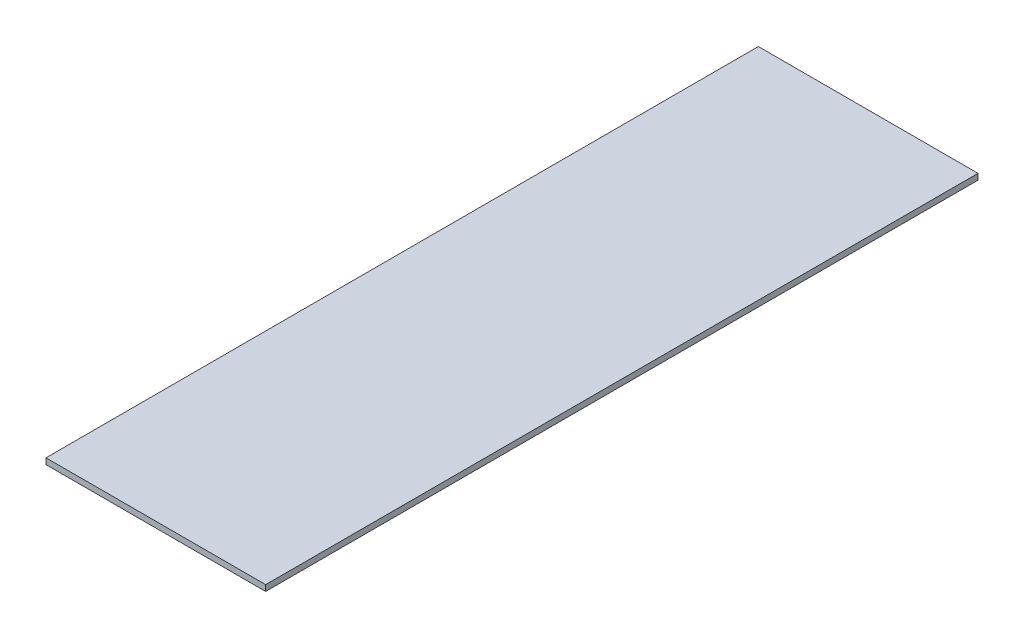
ISO-10303-21;
HEADER;
FILE_DESCRIPTION(('STEP AP214'),'2;1');
FILE_NAME('part.step','',(''),(''),'','','');
FILE_SCHEMA(('AUTOMOTIVE_DESIGN { 1 0 10303 214 1 1 1 1 }'));
ENDSEC;
DATA;
#1=APPLICATION_CONTEXT('core data for automotive mechanical design processes');
#2=APPLICATION_PROTOCOL_DEFINITION('international standard','automotive_design',2000,#1);
#3=PRODUCT_CONTEXT('',#1,'mechanical');
#4=PRODUCT('Part','Part','',(#3));
#5=PRODUCT_RELATED_PRODUCT_CATEGORY('part','',(#4));
#6=PRODUCT_DEFINITION_FORMATION('','',#4);
#7=PRODUCT_DEFINITION_CONTEXT('part definition',#1,'design');
#8=PRODUCT_DEFINITION('design','',#6,#7);
#9=PRODUCT_DEFINITION_SHAPE('','',#8);
#10=(LENGTH_UNIT() NAMED_UNIT(*) SI_UNIT(.MILLI.,.METRE.));
#11=(NAMED_UNIT(*) PLANE_ANGLE_UNIT() SI_UNIT($,.RADIAN.));
#12=(NAMED_UNIT(*) SI_UNIT($,.STERADIAN.) SOLID_ANGLE_UNIT());
#13=UNCERTAINTY_MEASURE_WITH_UNIT(LENGTH_MEASURE(1.E-05),#10,'distance_accuracy_value','');
#14=(GEOMETRIC_REPRESENTATION_CONTEXT(3) GLOBAL_UNCERTAINTY_ASSIGNED_CONTEXT((#13)) GLOBAL_UNIT_ASSIGNED_CONTEXT((#10,
#11,#12)) REPRESENTATION_CONTEXT('',''));
#15=CARTESIAN_POINT('',(0.,0.,0.));
#16=DIRECTION('',(0.,0.,1.));
#17=DIRECTION('',(1.,0.,0.));
#18=AXIS2_PLACEMENT_3D('',#15,#16,#17);
#19=CARTESIAN_POINT('',(117.475,-3.175,-381.));
#20=DIRECTION('',(1.,0.,0.));
#21=DIRECTION('',(0.,0.,-1.));
#22=AXIS2_PLACEMENT_3D('',#19,#20,#21);
#23=PLANE('',#22);
#24=DIRECTION('',(0.,1.,0.));
#25=VECTOR('',#24,1.);
#26=CARTESIAN_POINT('',(117.475,-3.175,-381.));
#27=LINE('',#26,#25);
#28=CARTESIAN_POINT('',(117.475,-3.175,-381.));
#29=VERTEX_POINT('',#28);
#30=CARTESIAN_POINT('',(117.475,3.175,-381.));
#31=VERTEX_POINT('',#30);
#32=EDGE_CURVE('E40',#29,#31,#27,.T.);
#33=ORIENTED_EDGE('',*,*,#32,.T.);
#34=DIRECTION('',(0.,0.,-1.));
#35=VECTOR('',#34,1.);
#36=CARTESIAN_POINT('',(117.475,3.175,-381.));
#37=LINE('',#36,#35);
#38=CARTESIAN_POINT('',(117.475,3.175,381.));
#39=VERTEX_POINT('',#38);
#40=EDGE_CURVE('E77',#39,#31,#37,.T.);
#41=ORIENTED_EDGE('',*,*,#40,.F.);
#42=DIRECTION('',(0.,1.,0.));
#43=VECTOR('',#42,1.);
#44=CARTESIAN_POINT('',(117.475,-3.175,381.));
#45=LINE('',#44,#43);
#46=CARTESIAN_POINT('',(117.475,-3.175,381.));
#47=VERTEX_POINT('',#46);
#48=EDGE_CURVE('E11',#47,#39,#45,.T.);
#49=ORIENTED_EDGE('',*,*,#48,.F.);
#50=DIRECTION('',(0.,0.,-1.));
#51=VECTOR('',#50,1.);
#52=CARTESIAN_POINT('',(117.475,-3.175,-381.));
#53=LINE('',#52,#51);
#54=EDGE_CURVE('E78',#47,#29,#53,.T.);
#55=ORIENTED_EDGE('',*,*,#54,.T.);
#56=EDGE_LOOP('',(#33,#41,#49,#55));
#57=FACE_BOUND('',#56,.T.);
#58=ADVANCED_FACE('F37',(#57),#23,.T.);
#59=CARTESIAN_POINT('',(-117.475,-3.175,381.));
#60=DIRECTION('',(0.,0.,1.));
#61=DIRECTION('',(1.,0.,0.));
#62=AXIS2_PLACEMENT_3D('',#59,#60,#61);
#63=PLANE('',#62);
#64=ORIENTED_EDGE('',*,*,#48,.T.);
#65=DIRECTION('',(1.,0.,0.));
#66=VECTOR('',#65,1.);
#67=CARTESIAN_POINT('',(-117.475,3.175,381.));
#68=LINE('',#67,#66);
#69=CARTESIAN_POINT('',(-117.475,3.175,381.));
#70=VERTEX_POINT('',#69);
#71=EDGE_CURVE('E94',#70,#39,#68,.T.);
#72=ORIENTED_EDGE('',*,*,#71,.F.);
#73=DIRECTION('',(0.,1.,0.));
#74=VECTOR('',#73,1.);
#75=CARTESIAN_POINT('',(-117.475,-3.175,381.));
#76=LINE('',#75,#74);
#77=CARTESIAN_POINT('',(-117.475,-3.175,381.));
#78=VERTEX_POINT('',#77);
#79=EDGE_CURVE('E45',#78,#70,#76,.T.);
#80=ORIENTED_EDGE('',*,*,#79,.F.);
#81=DIRECTION('',(1.,0.,0.));
#82=VECTOR('',#81,1.);
#83=CARTESIAN_POINT('',(-117.475,-3.175,381.));
#84=LINE('',#83,#82);
#85=EDGE_CURVE('E83',#78,#47,#84,.T.);
#86=ORIENTED_EDGE('',*,*,#85,.T.);
#87=EDGE_LOOP('',(#64,#72,#80,#86));
#88=FACE_BOUND('',#87,.T.);
#89=ADVANCED_FACE('F109',(#88),#63,.T.);
#90=CARTESIAN_POINT('',(-117.475,-3.175,-381.));
#91=DIRECTION('',(-1.,0.,0.));
#92=DIRECTION('',(0.,0.,1.));
#93=AXIS2_PLACEMENT_3D('',#90,#91,#92);
#94=PLANE('',#93);
#95=ORIENTED_EDGE('',*,*,#79,.T.);
#96=DIRECTION('',(0.,0.,1.));
#97=VECTOR('',#96,1.);
#98=CARTESIAN_POINT('',(-117.475,3.175,-381.));
#99=LINE('',#98,#97);
#100=CARTESIAN_POINT('',(-117.475,3.175,-381.));
#101=VERTEX_POINT('',#100);
#102=EDGE_CURVE('E90',#101,#70,#99,.T.);
#103=ORIENTED_EDGE('',*,*,#102,.F.);
#104=DIRECTION('',(0.,1.,0.));
#105=VECTOR('',#104,1.);
#106=CARTESIAN_POINT('',(-117.475,-3.175,-381.));
#107=LINE('',#106,#105);
#108=CARTESIAN_POINT('',(-117.475,-3.175,-381.));
#109=VERTEX_POINT('',#108);
#110=EDGE_CURVE('E82',#109,#101,#107,.T.);
#111=ORIENTED_EDGE('',*,*,#110,.F.);
#112=DIRECTION('',(0.,0.,1.));
#113=VECTOR('',#112,1.);
#114=CARTESIAN_POINT('',(-117.475,-3.175,-381.));
#115=LINE('',#114,#113);
#116=EDGE_CURVE('E102',#109,#78,#115,.T.);
#117=ORIENTED_EDGE('',*,*,#116,.T.);
#118=EDGE_LOOP('',(#95,#103,#111,#117));
#119=FACE_BOUND('',#118,.T.);
#120=ADVANCED_FACE('F106',(#119),#94,.T.);
#121=CARTESIAN_POINT('',(-117.475,-3.175,-381.));
#122=DIRECTION('',(0.,0.,-1.));
#123=DIRECTION('',(-1.,0.,0.));
#124=AXIS2_PLACEMENT_3D('',#121,#122,#123);
#125=PLANE('',#124);
#126=ORIENTED_EDGE('',*,*,#110,.T.);
#127=DIRECTION('',(-1.,0.,0.));
#128=VECTOR('',#127,1.);
#129=CARTESIAN_POINT('',(-117.475,3.175,-381.));
#130=LINE('',#129,#128);
#131=EDGE_CURVE('E85',#31,#101,#130,.T.);
#132=ORIENTED_EDGE('',*,*,#131,.F.);
#133=ORIENTED_EDGE('',*,*,#32,.F.);
#134=DIRECTION('',(-1.,0.,0.));
#135=VECTOR('',#134,1.);
#136=CARTESIAN_POINT('',(-117.475,-3.175,-381.));
#137=LINE('',#136,#135);
#138=EDGE_CURVE('E100',#29,#109,#137,.T.);
#139=ORIENTED_EDGE('',*,*,#138,.T.);
#140=EDGE_LOOP('',(#126,#132,#133,#139));
#141=FACE_BOUND('',#140,.T.);
#142=ADVANCED_FACE('F86',(#141),#125,.T.);
#143=CARTESIAN_POINT('',(0.,-3.175,0.));
#144=DIRECTION('',(0.,1.,0.));
#145=DIRECTION('',(0.,0.,1.));
#146=AXIS2_PLACEMENT_3D('',#143,#144,#145);
#147=PLANE('',#146);
#148=ORIENTED_EDGE('',*,*,#54,.F.);
#149=ORIENTED_EDGE('',*,*,#85,.F.);
#150=ORIENTED_EDGE('',*,*,#116,.F.);
#151=ORIENTED_EDGE('',*,*,#138,.F.);
#152=EDGE_LOOP('',(#148,#149,#150,#151));
#153=FACE_BOUND('',#152,.T.);
#154=ADVANCED_FACE('F111',(#153),#147,.F.);
#155=CARTESIAN_POINT('',(0.,3.175,0.));
#156=DIRECTION('',(0.,1.,0.));
#157=DIRECTION('',(0.,0.,1.));
#158=AXIS2_PLACEMENT_3D('',#155,#156,#157);
#159=PLANE('',#158);
#160=ORIENTED_EDGE('',*,*,#40,.T.);
#161=ORIENTED_EDGE('',*,*,#131,.T.);
#162=ORIENTED_EDGE('',*,*,#102,.T.);
#163=ORIENTED_EDGE('',*,*,#71,.T.);
#164=EDGE_LOOP('',(#160,#161,#162,#163));
#165=FACE_BOUND('',#164,.T.);
#166=ADVANCED_FACE('F93',(#165),#159,.T.);
#167=CLOSED_SHELL('',(#58,#89,#120,#142,#154,#166));
#168=MANIFOLD_SOLID_BREP('B2',#167);
#169=ADVANCED_BREP_SHAPE_REPRESENTATION('',(#18,#168),#14);
#170=SHAPE_DEFINITION_REPRESENTATION(#9,#169);
ENDSEC;
END-ISO-10303-21;
